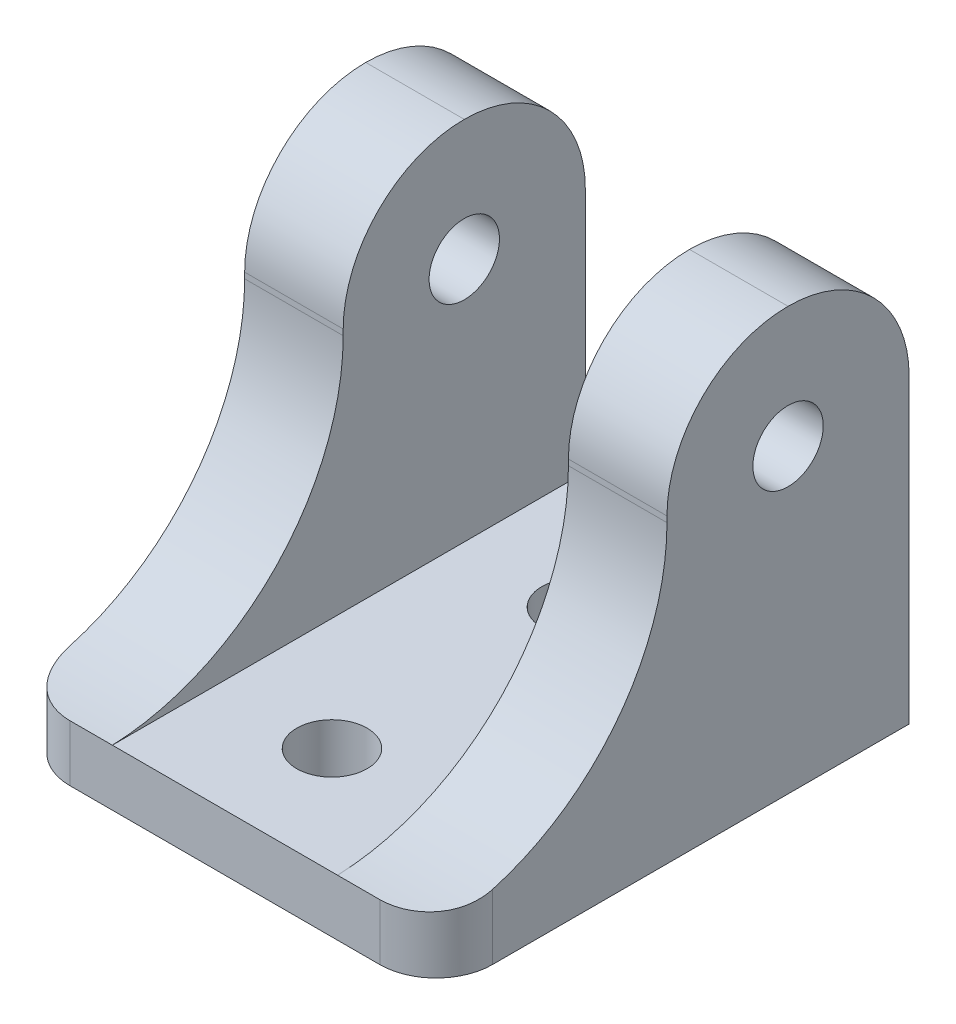
ISO-10303-21;
HEADER;
FILE_DESCRIPTION(('STEP AP214'),'2;1');
FILE_NAME('part.step','',(''),(''),'','','');
FILE_SCHEMA(('AUTOMOTIVE_DESIGN { 1 0 10303 214 1 1 1 1 }'));
ENDSEC;
DATA;
#1=APPLICATION_CONTEXT('core data for automotive mechanical design processes');
#2=APPLICATION_PROTOCOL_DEFINITION('international standard','automotive_design',2000,#1);
#3=PRODUCT_CONTEXT('',#1,'mechanical');
#4=PRODUCT('Part','Part','',(#3));
#5=PRODUCT_RELATED_PRODUCT_CATEGORY('part','',(#4));
#6=PRODUCT_DEFINITION_FORMATION('','',#4);
#7=PRODUCT_DEFINITION_CONTEXT('part definition',#1,'design');
#8=PRODUCT_DEFINITION('design','',#6,#7);
#9=PRODUCT_DEFINITION_SHAPE('','',#8);
#10=(LENGTH_UNIT() NAMED_UNIT(*) SI_UNIT(.MILLI.,.METRE.));
#11=(NAMED_UNIT(*) PLANE_ANGLE_UNIT() SI_UNIT($,.RADIAN.));
#12=(NAMED_UNIT(*) SI_UNIT($,.STERADIAN.) SOLID_ANGLE_UNIT());
#13=UNCERTAINTY_MEASURE_WITH_UNIT(LENGTH_MEASURE(1.E-05),#10,'distance_accuracy_value','');
#14=(GEOMETRIC_REPRESENTATION_CONTEXT(3) GLOBAL_UNCERTAINTY_ASSIGNED_CONTEXT((#13)) GLOBAL_UNIT_ASSIGNED_CONTEXT((#10,
#11,#12)) REPRESENTATION_CONTEXT('',''));
#15=CARTESIAN_POINT('',(0.,0.,0.));
#16=DIRECTION('',(0.,0.,1.));
#17=DIRECTION('',(1.,0.,0.));
#18=AXIS2_PLACEMENT_3D('',#15,#16,#17);
#19=CARTESIAN_POINT('',(0.,5.08,0.));
#20=DIRECTION('',(0.,1.,0.));
#21=DIRECTION('',(0.,0.,1.));
#22=AXIS2_PLACEMENT_3D('',#19,#20,#21);
#23=PLANE('',#22);
#24=CARTESIAN_POINT('',(1.65206317403409,5.08,13.9537678619551));
#25=DIRECTION('',(0.,1.,0.));
#26=DIRECTION('',(0.,0.,1.));
#27=AXIS2_PLACEMENT_3D('',#24,#25,#26);
#28=CIRCLE('',#27,3.175);
#29=CARTESIAN_POINT('',(1.65206317403409,5.08,17.1287678619551));
#30=VERTEX_POINT('',#29);
#31=EDGE_CURVE('E552',#30,#30,#28,.T.);
#32=ORIENTED_EDGE('',*,*,#31,.F.);
#33=EDGE_LOOP('',(#32));
#34=FACE_BOUND('',#33,.T.);
#35=CARTESIAN_POINT('',(1.65206317403409,5.08,-8.14423213804486));
#36=DIRECTION('',(0.,1.,0.));
#37=DIRECTION('',(0.,0.,1.));
#38=AXIS2_PLACEMENT_3D('',#35,#36,#37);
#39=CIRCLE('',#38,3.175);
#40=CARTESIAN_POINT('',(1.65206317403409,5.08,-4.96923213804486));
#41=VERTEX_POINT('',#40);
#42=EDGE_CURVE('E247',#41,#41,#39,.T.);
#43=ORIENTED_EDGE('',*,*,#42,.F.);
#44=EDGE_LOOP('',(#43));
#45=FACE_BOUND('',#44,.T.);
#46=DIRECTION('',(1.,0.,0.));
#47=VECTOR('',#46,1.);
#48=CARTESIAN_POINT('',(-17.3979368259659,5.08,23.6057678619551));
#49=LINE('',#48,#47);
#50=CARTESIAN_POINT('',(-8.50793682596591,5.08,23.6057678619551));
#51=VERTEX_POINT('',#50);
#52=CARTESIAN_POINT('',(11.8120631740341,5.08,23.6057678619551));
#53=VERTEX_POINT('',#52);
#54=EDGE_CURVE('E171',#51,#53,#49,.T.);
#55=ORIENTED_EDGE('',*,*,#54,.T.);
#56=DIRECTION('',(0.,0.,1.));
#57=VECTOR('',#56,1.);
#58=CARTESIAN_POINT('',(11.8120631740341,5.08,-19.0662321380449));
#59=LINE('',#58,#57);
#60=CARTESIAN_POINT('',(11.8120631740341,5.08,-19.0662321380449));
#61=VERTEX_POINT('',#60);
#62=EDGE_CURVE('E181',#61,#53,#59,.T.);
#63=ORIENTED_EDGE('',*,*,#62,.F.);
#64=DIRECTION('',(-1.,0.,0.));
#65=VECTOR('',#64,1.);
#66=CARTESIAN_POINT('',(-17.3979368259659,5.08,-19.0662321380449));
#67=LINE('',#66,#65);
#68=CARTESIAN_POINT('',(-8.50793682596592,5.08,-19.0662321380449));
#69=VERTEX_POINT('',#68);
#70=EDGE_CURVE('E176',#61,#69,#67,.T.);
#71=ORIENTED_EDGE('',*,*,#70,.T.);
#72=DIRECTION('',(0.,0.,-1.));
#73=VECTOR('',#72,1.);
#74=CARTESIAN_POINT('',(-8.50793682596592,5.08,-19.0662321380449));
#75=LINE('',#74,#73);
#76=EDGE_CURVE('E254',#51,#69,#75,.T.);
#77=ORIENTED_EDGE('',*,*,#76,.F.);
#78=EDGE_LOOP('',(#55,#63,#71,#77));
#79=FACE_BOUND('',#78,.T.);
#80=ADVANCED_FACE('F33',(#34,#45,#79),#23,.T.);
#81=CARTESIAN_POINT('',(-17.3979368259659,5.08,-19.0662321380449));
#82=DIRECTION('',(1.,0.,0.));
#83=DIRECTION('',(0.,0.,-1.));
#84=AXIS2_PLACEMENT_3D('',#81,#82,#83);
#85=PLANE('',#84);
#86=CARTESIAN_POINT('',(-17.3979368259659,27.178,-8.14423213804485));
#87=DIRECTION('',(1.,0.,0.));
#88=DIRECTION('',(0.,0.,-1.));
#89=AXIS2_PLACEMENT_3D('',#86,#87,#88);
#90=CIRCLE('',#89,3.17499999999999);
#91=CARTESIAN_POINT('',(-17.3979368259659,27.178,-11.3192321380448));
#92=VERTEX_POINT('',#91);
#93=EDGE_CURVE('E240',#92,#92,#90,.T.);
#94=ORIENTED_EDGE('',*,*,#93,.T.);
#95=EDGE_LOOP('',(#94));
#96=FACE_BOUND('',#95,.T.);
#97=DIRECTION('',(0.,0.,1.));
#98=VECTOR('',#97,1.);
#99=CARTESIAN_POINT('',(-17.3979368259659,0.,-19.0662321380449));
#100=LINE('',#99,#98);
#101=CARTESIAN_POINT('',(-17.3979368259659,0.,-19.0662321380449));
#102=VERTEX_POINT('',#101);
#103=CARTESIAN_POINT('',(-17.3979368259659,0.,18.5257678619551));
#104=VERTEX_POINT('',#103);
#105=EDGE_CURVE('E168',#102,#104,#100,.T.);
#106=ORIENTED_EDGE('',*,*,#105,.T.);
#107=DIRECTION('',(0.,-1.,0.));
#108=VECTOR('',#107,1.);
#109=CARTESIAN_POINT('',(-17.3979368259659,5.08,18.5257678619551));
#110=LINE('',#109,#108);
#111=CARTESIAN_POINT('',(-17.3979368259659,5.87195984469439,18.5257678619551));
#112=VERTEX_POINT('',#111);
#113=EDGE_CURVE('E57',#104,#112,#110,.F.);
#114=ORIENTED_EDGE('',*,*,#113,.T.);
#115=CARTESIAN_POINT('',(-17.3979368259659,26.6565487509008,24.3677678619551));
#116=DIRECTION('',(1.,0.,0.));
#117=DIRECTION('',(0.,0.,-1.));
#118=AXIS2_PLACEMENT_3D('',#115,#116,#117);
#119=CIRCLE('',#118,21.59);
#120=CARTESIAN_POINT('',(-17.3979368259659,26.6565487509008,2.77776786195515));
#121=VERTEX_POINT('',#120);
#122=EDGE_CURVE('E199',#112,#121,#119,.T.);
#123=ORIENTED_EDGE('',*,*,#122,.T.);
#124=DIRECTION('',(0.,-1.,0.));
#125=VECTOR('',#124,1.);
#126=CARTESIAN_POINT('',(-17.3979368259659,38.1,2.77776786195515));
#127=LINE('',#126,#125);
#128=CARTESIAN_POINT('',(-17.3979368259659,27.178,2.77776786195515));
#129=VERTEX_POINT('',#128);
#130=EDGE_CURVE('E263',#129,#121,#127,.T.);
#131=ORIENTED_EDGE('',*,*,#130,.F.);
#132=CARTESIAN_POINT('',(-17.3979368259659,27.178,-8.14423213804485));
#133=DIRECTION('',(1.,0.,0.));
#134=DIRECTION('',(0.,0.,-1.));
#135=AXIS2_PLACEMENT_3D('',#132,#133,#134);
#136=CIRCLE('',#135,10.922);
#137=CARTESIAN_POINT('',(-17.3979368259659,38.1,-8.14423213804485));
#138=VERTEX_POINT('',#137);
#139=EDGE_CURVE('E163',#129,#138,#136,.F.);
#140=ORIENTED_EDGE('',*,*,#139,.T.);
#141=CARTESIAN_POINT('',(-17.3979368259659,27.178,-8.14423213804486));
#142=DIRECTION('',(1.,0.,0.));
#143=DIRECTION('',(0.,0.,-1.));
#144=AXIS2_PLACEMENT_3D('',#141,#142,#143);
#145=CIRCLE('',#144,10.922);
#146=CARTESIAN_POINT('',(-17.3979368259659,27.178,-19.0662321380449));
#147=VERTEX_POINT('',#146);
#148=EDGE_CURVE('E288',#138,#147,#145,.F.);
#149=ORIENTED_EDGE('',*,*,#148,.T.);
#150=DIRECTION('',(0.,-1.,0.));
#151=VECTOR('',#150,1.);
#152=CARTESIAN_POINT('',(-17.3979368259659,5.08,-19.0662321380449));
#153=LINE('',#152,#151);
#154=EDGE_CURVE('E164',#147,#102,#153,.T.);
#155=ORIENTED_EDGE('',*,*,#154,.T.);
#156=EDGE_LOOP('',(#106,#114,#123,#131,#140,#149,#155));
#157=FACE_BOUND('',#156,.T.);
#158=ADVANCED_FACE('F345',(#96,#157),#85,.F.);
#159=CARTESIAN_POINT('',(-17.3979368259659,5.08,23.6057678619551));
#160=DIRECTION('',(0.,0.,-1.));
#161=DIRECTION('',(-1.,0.,0.));
#162=AXIS2_PLACEMENT_3D('',#159,#160,#161);
#163=PLANE('',#162);
#164=CARTESIAN_POINT('',(-12.3179368259659,5.08,23.6057678619551));
#165=VERTEX_POINT('',#164);
#166=EDGE_CURVE('E173',#165,#51,#49,.T.);
#167=ORIENTED_EDGE('',*,*,#166,.F.);
#168=DIRECTION('',(0.,-1.,0.));
#169=VECTOR('',#168,1.);
#170=CARTESIAN_POINT('',(-12.3179368259659,5.08,23.6057678619551));
#171=LINE('',#170,#169);
#172=CARTESIAN_POINT('',(-12.3179368259659,0.,23.6057678619551));
#173=VERTEX_POINT('',#172);
#174=EDGE_CURVE('E196',#165,#173,#171,.T.);
#175=ORIENTED_EDGE('',*,*,#174,.T.);
#176=DIRECTION('',(1.,0.,0.));
#177=VECTOR('',#176,1.);
#178=CARTESIAN_POINT('',(-17.3979368259659,0.,23.6057678619551));
#179=LINE('',#178,#177);
#180=CARTESIAN_POINT('',(15.6220631740341,0.,23.6057678619551));
#181=VERTEX_POINT('',#180);
#182=EDGE_CURVE('E152',#173,#181,#179,.T.);
#183=ORIENTED_EDGE('',*,*,#182,.T.);
#184=DIRECTION('',(0.,-1.,0.));
#185=VECTOR('',#184,1.);
#186=CARTESIAN_POINT('',(15.6220631740341,5.08,23.6057678619551));
#187=LINE('',#186,#185);
#188=CARTESIAN_POINT('',(15.6220631740341,5.08,23.6057678619551));
#189=VERTEX_POINT('',#188);
#190=EDGE_CURVE('E194',#181,#189,#187,.F.);
#191=ORIENTED_EDGE('',*,*,#190,.T.);
#192=EDGE_CURVE('E169',#53,#189,#49,.T.);
#193=ORIENTED_EDGE('',*,*,#192,.F.);
#194=ORIENTED_EDGE('',*,*,#54,.F.);
#195=EDGE_LOOP('',(#167,#175,#183,#191,#193,#194));
#196=FACE_BOUND('',#195,.T.);
#197=ADVANCED_FACE('F192',(#196),#163,.F.);
#198=CARTESIAN_POINT('',(20.7020631740341,5.08,-19.0662321380449));
#199=DIRECTION('',(-1.,0.,0.));
#200=DIRECTION('',(0.,0.,1.));
#201=AXIS2_PLACEMENT_3D('',#198,#199,#200);
#202=PLANE('',#201);
#203=CARTESIAN_POINT('',(20.7020631740341,27.178,-8.14423213804486));
#204=DIRECTION('',(1.,0.,0.));
#205=DIRECTION('',(0.,0.,-1.));
#206=AXIS2_PLACEMENT_3D('',#203,#204,#205);
#207=CIRCLE('',#206,3.175);
#208=CARTESIAN_POINT('',(20.7020631740341,27.178,-11.3192321380449));
#209=VERTEX_POINT('',#208);
#210=EDGE_CURVE('E236',#209,#209,#207,.T.);
#211=ORIENTED_EDGE('',*,*,#210,.F.);
#212=EDGE_LOOP('',(#211));
#213=FACE_BOUND('',#212,.T.);
#214=CARTESIAN_POINT('',(20.7020631740341,26.6565487509008,24.3677678619551));
#215=DIRECTION('',(-1.,0.,0.));
#216=DIRECTION('',(0.,0.,1.));
#217=AXIS2_PLACEMENT_3D('',#214,#215,#216);
#218=CIRCLE('',#217,21.59);
#219=CARTESIAN_POINT('',(20.7020631740341,26.6565487509008,2.77776786195515));
#220=VERTEX_POINT('',#219);
#221=CARTESIAN_POINT('',(20.7020631740341,5.87195984469439,18.5257678619551));
#222=VERTEX_POINT('',#221);
#223=EDGE_CURVE('E318',#220,#222,#218,.T.);
#224=ORIENTED_EDGE('',*,*,#223,.T.);
#225=DIRECTION('',(0.,-1.,0.));
#226=VECTOR('',#225,1.);
#227=CARTESIAN_POINT('',(20.7020631740341,5.08,18.5257678619551));
#228=LINE('',#227,#226);
#229=CARTESIAN_POINT('',(20.7020631740341,0.,18.5257678619551));
#230=VERTEX_POINT('',#229);
#231=EDGE_CURVE('E43',#222,#230,#228,.T.);
#232=ORIENTED_EDGE('',*,*,#231,.T.);
#233=DIRECTION('',(0.,0.,-1.));
#234=VECTOR('',#233,1.);
#235=CARTESIAN_POINT('',(20.7020631740341,0.,-19.0662321380449));
#236=LINE('',#235,#234);
#237=CARTESIAN_POINT('',(20.7020631740341,0.,-19.0662321380449));
#238=VERTEX_POINT('',#237);
#239=EDGE_CURVE('E144',#230,#238,#236,.T.);
#240=ORIENTED_EDGE('',*,*,#239,.T.);
#241=DIRECTION('',(0.,-1.,0.));
#242=VECTOR('',#241,1.);
#243=CARTESIAN_POINT('',(20.7020631740341,5.08,-19.0662321380449));
#244=LINE('',#243,#242);
#245=CARTESIAN_POINT('',(20.7020631740341,27.178,-19.0662321380449));
#246=VERTEX_POINT('',#245);
#247=EDGE_CURVE('E147',#246,#238,#244,.T.);
#248=ORIENTED_EDGE('',*,*,#247,.F.);
#249=CARTESIAN_POINT('',(20.7020631740341,27.178,-8.14423213804486));
#250=DIRECTION('',(-1.,0.,0.));
#251=DIRECTION('',(0.,0.,1.));
#252=AXIS2_PLACEMENT_3D('',#249,#250,#251);
#253=CIRCLE('',#252,10.922);
#254=CARTESIAN_POINT('',(20.7020631740341,38.1,-8.14423213804485));
#255=VERTEX_POINT('',#254);
#256=EDGE_CURVE('E302',#246,#255,#253,.F.);
#257=ORIENTED_EDGE('',*,*,#256,.T.);
#258=CARTESIAN_POINT('',(20.7020631740341,27.178,-8.14423213804485));
#259=DIRECTION('',(-1.,0.,0.));
#260=DIRECTION('',(0.,0.,1.));
#261=AXIS2_PLACEMENT_3D('',#258,#259,#260);
#262=CIRCLE('',#261,10.922);
#263=CARTESIAN_POINT('',(20.7020631740341,27.178,2.77776786195515));
#264=VERTEX_POINT('',#263);
#265=EDGE_CURVE('E281',#255,#264,#262,.F.);
#266=ORIENTED_EDGE('',*,*,#265,.T.);
#267=DIRECTION('',(0.,-1.,0.));
#268=VECTOR('',#267,1.);
#269=CARTESIAN_POINT('',(20.7020631740341,38.1,2.77776786195515));
#270=LINE('',#269,#268);
#271=EDGE_CURVE('E267',#264,#220,#270,.T.);
#272=ORIENTED_EDGE('',*,*,#271,.T.);
#273=EDGE_LOOP('',(#224,#232,#240,#248,#257,#266,#272));
#274=FACE_BOUND('',#273,.T.);
#275=ADVANCED_FACE('F146',(#213,#274),#202,.F.);
#276=CARTESIAN_POINT('',(-17.3979368259659,5.08,-19.0662321380449));
#277=DIRECTION('',(0.,0.,1.));
#278=DIRECTION('',(1.,0.,0.));
#279=AXIS2_PLACEMENT_3D('',#276,#277,#278);
#280=PLANE('',#279);
#281=ORIENTED_EDGE('',*,*,#154,.F.);
#282=DIRECTION('',(-1.,0.,0.));
#283=VECTOR('',#282,1.);
#284=CARTESIAN_POINT('',(-8.50793682596592,27.178,-19.0662321380449));
#285=LINE('',#284,#283);
#286=CARTESIAN_POINT('',(-8.50793682596592,27.178,-19.0662321380449));
#287=VERTEX_POINT('',#286);
#288=EDGE_CURVE('E291',#147,#287,#285,.F.);
#289=ORIENTED_EDGE('',*,*,#288,.T.);
#290=DIRECTION('',(0.,-1.,0.));
#291=VECTOR('',#290,1.);
#292=CARTESIAN_POINT('',(-8.50793682596592,38.1,-19.0662321380449));
#293=LINE('',#292,#291);
#294=EDGE_CURVE('E257',#287,#69,#293,.T.);
#295=ORIENTED_EDGE('',*,*,#294,.T.);
#296=ORIENTED_EDGE('',*,*,#70,.F.);
#297=DIRECTION('',(0.,-1.,0.));
#298=VECTOR('',#297,1.);
#299=CARTESIAN_POINT('',(11.8120631740341,38.1,-19.0662321380449));
#300=LINE('',#299,#298);
#301=CARTESIAN_POINT('',(11.8120631740341,27.178,-19.0662321380449));
#302=VERTEX_POINT('',#301);
#303=EDGE_CURVE('E186',#302,#61,#300,.T.);
#304=ORIENTED_EDGE('',*,*,#303,.F.);
#305=DIRECTION('',(-1.,0.,0.));
#306=VECTOR('',#305,1.);
#307=CARTESIAN_POINT('',(-17.3979368259659,27.178,-19.0662321380449));
#308=LINE('',#307,#306);
#309=EDGE_CURVE('E162',#302,#246,#308,.F.);
#310=ORIENTED_EDGE('',*,*,#309,.T.);
#311=ORIENTED_EDGE('',*,*,#247,.T.);
#312=DIRECTION('',(-1.,0.,0.));
#313=VECTOR('',#312,1.);
#314=CARTESIAN_POINT('',(-17.3979368259659,0.,-19.0662321380449));
#315=LINE('',#314,#313);
#316=EDGE_CURVE('E151',#238,#102,#315,.T.);
#317=ORIENTED_EDGE('',*,*,#316,.T.);
#318=EDGE_LOOP('',(#281,#289,#295,#296,#304,#310,#311,#317));
#319=FACE_BOUND('',#318,.T.);
#320=ADVANCED_FACE('F158',(#319),#280,.F.);
#321=CARTESIAN_POINT('',(0.,0.,0.));
#322=DIRECTION('',(0.,1.,0.));
#323=DIRECTION('',(0.,0.,1.));
#324=AXIS2_PLACEMENT_3D('',#321,#322,#323);
#325=PLANE('',#324);
#326=CARTESIAN_POINT('',(1.65206317403409,0.,13.9537678619551));
#327=DIRECTION('',(0.,1.,0.));
#328=DIRECTION('',(0.,0.,1.));
#329=AXIS2_PLACEMENT_3D('',#326,#327,#328);
#330=CIRCLE('',#329,3.17499999999999);
#331=CARTESIAN_POINT('',(1.65206317403409,0.,17.1287678619551));
#332=VERTEX_POINT('',#331);
#333=EDGE_CURVE('E555',#332,#332,#330,.T.);
#334=ORIENTED_EDGE('',*,*,#333,.T.);
#335=EDGE_LOOP('',(#334));
#336=FACE_BOUND('',#335,.T.);
#337=CARTESIAN_POINT('',(1.65206317403409,0.,-8.14423213804486));
#338=DIRECTION('',(0.,1.,0.));
#339=DIRECTION('',(0.,0.,1.));
#340=AXIS2_PLACEMENT_3D('',#337,#338,#339);
#341=CIRCLE('',#340,3.17499999999999);
#342=CARTESIAN_POINT('',(1.65206317403409,0.,-4.96923213804486));
#343=VERTEX_POINT('',#342);
#344=EDGE_CURVE('E38',#343,#343,#341,.T.);
#345=ORIENTED_EDGE('',*,*,#344,.T.);
#346=EDGE_LOOP('',(#345));
#347=FACE_BOUND('',#346,.T.);
#348=ORIENTED_EDGE('',*,*,#182,.F.);
#349=CARTESIAN_POINT('',(-12.3179368259659,0.,18.5257678619551));
#350=DIRECTION('',(0.,1.,0.));
#351=DIRECTION('',(0.,0.,1.));
#352=AXIS2_PLACEMENT_3D('',#349,#350,#351);
#353=CIRCLE('',#352,5.08);
#354=EDGE_CURVE('E207',#173,#104,#353,.F.);
#355=ORIENTED_EDGE('',*,*,#354,.T.);
#356=ORIENTED_EDGE('',*,*,#105,.F.);
#357=ORIENTED_EDGE('',*,*,#316,.F.);
#358=ORIENTED_EDGE('',*,*,#239,.F.);
#359=CARTESIAN_POINT('',(15.6220631740341,0.,18.5257678619551));
#360=DIRECTION('',(0.,1.,0.));
#361=DIRECTION('',(0.,0.,1.));
#362=AXIS2_PLACEMENT_3D('',#359,#360,#361);
#363=CIRCLE('',#362,5.08);
#364=EDGE_CURVE('E198',#230,#181,#363,.F.);
#365=ORIENTED_EDGE('',*,*,#364,.T.);
#366=EDGE_LOOP('',(#348,#355,#356,#357,#358,#365));
#367=FACE_BOUND('',#366,.T.);
#368=ADVANCED_FACE('F167',(#336,#347,#367),#325,.F.);
#369=CARTESIAN_POINT('',(11.8120631740341,38.1,-19.0662321380449));
#370=DIRECTION('',(1.,0.,0.));
#371=DIRECTION('',(0.,0.,-1.));
#372=AXIS2_PLACEMENT_3D('',#369,#370,#371);
#373=PLANE('',#372);
#374=CARTESIAN_POINT('',(11.8120631740341,27.178,-8.14423213804485));
#375=DIRECTION('',(1.,0.,0.));
#376=DIRECTION('',(0.,0.,-1.));
#377=AXIS2_PLACEMENT_3D('',#374,#375,#376);
#378=CIRCLE('',#377,3.17499999999999);
#379=CARTESIAN_POINT('',(11.8120631740341,27.178,-11.3192321380448));
#380=VERTEX_POINT('',#379);
#381=EDGE_CURVE('E235',#380,#380,#378,.T.);
#382=ORIENTED_EDGE('',*,*,#381,.T.);
#383=EDGE_LOOP('',(#382));
#384=FACE_BOUND('',#383,.T.);
#385=CARTESIAN_POINT('',(11.8120631740341,27.178,-8.14423213804485));
#386=DIRECTION('',(1.,0.,0.));
#387=DIRECTION('',(0.,0.,-1.));
#388=AXIS2_PLACEMENT_3D('',#385,#386,#387);
#389=CIRCLE('',#388,10.922);
#390=CARTESIAN_POINT('',(11.8120631740341,27.178,2.77776786195515));
#391=VERTEX_POINT('',#390);
#392=CARTESIAN_POINT('',(11.8120631740341,38.1,-8.14423213804485));
#393=VERTEX_POINT('',#392);
#394=EDGE_CURVE('E297',#391,#393,#389,.F.);
#395=ORIENTED_EDGE('',*,*,#394,.T.);
#396=CARTESIAN_POINT('',(11.8120631740341,27.178,-8.14423213804486));
#397=DIRECTION('',(1.,0.,0.));
#398=DIRECTION('',(0.,0.,-1.));
#399=AXIS2_PLACEMENT_3D('',#396,#397,#398);
#400=CIRCLE('',#399,10.922);
#401=EDGE_CURVE('E279',#393,#302,#400,.F.);
#402=ORIENTED_EDGE('',*,*,#401,.T.);
#403=ORIENTED_EDGE('',*,*,#303,.T.);
#404=ORIENTED_EDGE('',*,*,#62,.T.);
#405=CARTESIAN_POINT('',(11.8120631740341,26.6565487509008,24.3677678619551));
#406=DIRECTION('',(1.,0.,0.));
#407=DIRECTION('',(0.,0.,-1.));
#408=AXIS2_PLACEMENT_3D('',#405,#406,#407);
#409=CIRCLE('',#408,21.59);
#410=CARTESIAN_POINT('',(11.8120631740341,26.6565487509008,2.77776786195515));
#411=VERTEX_POINT('',#410);
#412=EDGE_CURVE('E320',#53,#411,#409,.T.);
#413=ORIENTED_EDGE('',*,*,#412,.T.);
#414=DIRECTION('',(0.,-1.,0.));
#415=VECTOR('',#414,1.);
#416=CARTESIAN_POINT('',(11.8120631740341,38.1,2.77776786195515));
#417=LINE('',#416,#415);
#418=EDGE_CURVE('E265',#391,#411,#417,.T.);
#419=ORIENTED_EDGE('',*,*,#418,.F.);
#420=EDGE_LOOP('',(#395,#402,#403,#404,#413,#419));
#421=FACE_BOUND('',#420,.T.);
#422=ADVANCED_FACE('F367',(#384,#421),#373,.F.);
#423=CARTESIAN_POINT('',(20.7020631740341,38.1,2.77776786195515));
#424=DIRECTION('',(0.,0.,-1.));
#425=DIRECTION('',(-1.,0.,0.));
#426=AXIS2_PLACEMENT_3D('',#423,#424,#425);
#427=PLANE('',#426);
#428=ORIENTED_EDGE('',*,*,#418,.T.);
#429=DIRECTION('',(-1.,0.,0.));
#430=VECTOR('',#429,1.);
#431=CARTESIAN_POINT('',(20.7020631740341,26.6565487509008,2.77776786195515));
#432=LINE('',#431,#430);
#433=EDGE_CURVE('E309',#411,#220,#432,.F.);
#434=ORIENTED_EDGE('',*,*,#433,.T.);
#435=ORIENTED_EDGE('',*,*,#271,.F.);
#436=DIRECTION('',(1.,0.,0.));
#437=VECTOR('',#436,1.);
#438=CARTESIAN_POINT('',(20.7020631740341,27.178,2.77776786195515));
#439=LINE('',#438,#437);
#440=EDGE_CURVE('E304',#264,#391,#439,.F.);
#441=ORIENTED_EDGE('',*,*,#440,.T.);
#442=EDGE_LOOP('',(#428,#434,#435,#441));
#443=FACE_BOUND('',#442,.T.);
#444=ADVANCED_FACE('F389',(#443),#427,.F.);
#445=CARTESIAN_POINT('',(-17.3979368259659,38.1,2.77776786195515));
#446=DIRECTION('',(0.,0.,-1.));
#447=DIRECTION('',(-1.,0.,0.));
#448=AXIS2_PLACEMENT_3D('',#445,#446,#447);
#449=PLANE('',#448);
#450=ORIENTED_EDGE('',*,*,#130,.T.);
#451=DIRECTION('',(-1.,0.,0.));
#452=VECTOR('',#451,1.);
#453=CARTESIAN_POINT('',(-17.3979368259659,26.6565487509008,2.77776786195515));
#454=LINE('',#453,#452);
#455=CARTESIAN_POINT('',(-8.50793682596591,26.6565487509008,2.77776786195515));
#456=VERTEX_POINT('',#455);
#457=EDGE_CURVE('E315',#121,#456,#454,.F.);
#458=ORIENTED_EDGE('',*,*,#457,.T.);
#459=DIRECTION('',(0.,-1.,0.));
#460=VECTOR('',#459,1.);
#461=CARTESIAN_POINT('',(-8.50793682596591,38.1,2.77776786195515));
#462=LINE('',#461,#460);
#463=CARTESIAN_POINT('',(-8.50793682596591,27.178,2.77776786195515));
#464=VERTEX_POINT('',#463);
#465=EDGE_CURVE('E260',#464,#456,#462,.T.);
#466=ORIENTED_EDGE('',*,*,#465,.F.);
#467=DIRECTION('',(1.,0.,0.));
#468=VECTOR('',#467,1.);
#469=CARTESIAN_POINT('',(-17.3979368259659,27.178,2.77776786195515));
#470=LINE('',#469,#468);
#471=EDGE_CURVE('E305',#464,#129,#470,.F.);
#472=ORIENTED_EDGE('',*,*,#471,.T.);
#473=EDGE_LOOP('',(#450,#458,#466,#472));
#474=FACE_BOUND('',#473,.T.);
#475=ADVANCED_FACE('F348',(#474),#449,.F.);
#476=CARTESIAN_POINT('',(-8.50793682596592,38.1,-19.0662321380449));
#477=DIRECTION('',(-1.,0.,0.));
#478=DIRECTION('',(0.,0.,1.));
#479=AXIS2_PLACEMENT_3D('',#476,#477,#478);
#480=PLANE('',#479);
#481=CARTESIAN_POINT('',(-8.50793682596592,27.178,-8.14423213804485));
#482=DIRECTION('',(-1.,0.,0.));
#483=DIRECTION('',(0.,0.,1.));
#484=AXIS2_PLACEMENT_3D('',#481,#482,#483);
#485=CIRCLE('',#484,3.17499999999999);
#486=CARTESIAN_POINT('',(-8.50793682596592,27.178,-4.96923213804486));
#487=VERTEX_POINT('',#486);
#488=EDGE_CURVE('E233',#487,#487,#485,.T.);
#489=ORIENTED_EDGE('',*,*,#488,.T.);
#490=EDGE_LOOP('',(#489));
#491=FACE_BOUND('',#490,.T.);
#492=ORIENTED_EDGE('',*,*,#294,.F.);
#493=CARTESIAN_POINT('',(-8.50793682596592,27.178,-8.14423213804486));
#494=DIRECTION('',(-1.,0.,0.));
#495=DIRECTION('',(0.,0.,1.));
#496=AXIS2_PLACEMENT_3D('',#493,#494,#495);
#497=CIRCLE('',#496,10.922);
#498=CARTESIAN_POINT('',(-8.50793682596592,38.1,-8.14423213804485));
#499=VERTEX_POINT('',#498);
#500=EDGE_CURVE('E296',#287,#499,#497,.F.);
#501=ORIENTED_EDGE('',*,*,#500,.T.);
#502=CARTESIAN_POINT('',(-8.50793682596592,27.178,-8.14423213804485));
#503=DIRECTION('',(-1.,0.,0.));
#504=DIRECTION('',(0.,0.,1.));
#505=AXIS2_PLACEMENT_3D('',#502,#503,#504);
#506=CIRCLE('',#505,10.922);
#507=EDGE_CURVE('E294',#499,#464,#506,.F.);
#508=ORIENTED_EDGE('',*,*,#507,.T.);
#509=ORIENTED_EDGE('',*,*,#465,.T.);
#510=CARTESIAN_POINT('',(-8.50793682596591,26.6565487509008,24.3677678619551));
#511=DIRECTION('',(-1.,0.,0.));
#512=DIRECTION('',(0.,0.,1.));
#513=AXIS2_PLACEMENT_3D('',#510,#511,#512);
#514=CIRCLE('',#513,21.59);
#515=EDGE_CURVE('E202',#456,#51,#514,.T.);
#516=ORIENTED_EDGE('',*,*,#515,.T.);
#517=ORIENTED_EDGE('',*,*,#76,.T.);
#518=EDGE_LOOP('',(#492,#501,#508,#509,#516,#517));
#519=FACE_BOUND('',#518,.T.);
#520=ADVANCED_FACE('F325',(#491,#519),#480,.F.);
#521=CARTESIAN_POINT('',(0.,27.178,-8.14423213804485));
#522=DIRECTION('',(-1.,0.,0.));
#523=DIRECTION('',(0.,0.,1.));
#524=AXIS2_PLACEMENT_3D('',#521,#522,#523);
#525=CYLINDRICAL_SURFACE('',#524,10.922);
#526=ORIENTED_EDGE('',*,*,#471,.F.);
#527=ORIENTED_EDGE('',*,*,#507,.F.);
#528=DIRECTION('',(1.,0.,0.));
#529=VECTOR('',#528,1.);
#530=CARTESIAN_POINT('',(-8.50793682596591,38.1,-8.14423213804485));
#531=LINE('',#530,#529);
#532=EDGE_CURVE('E258',#138,#499,#531,.T.);
#533=ORIENTED_EDGE('',*,*,#532,.F.);
#534=ORIENTED_EDGE('',*,*,#139,.F.);
#535=EDGE_LOOP('',(#526,#527,#533,#534));
#536=FACE_BOUND('',#535,.T.);
#537=ADVANCED_FACE('F341',(#536),#525,.T.);
#538=CARTESIAN_POINT('',(0.,27.178,-8.14423213804486));
#539=DIRECTION('',(1.,0.,0.));
#540=DIRECTION('',(0.,0.,-1.));
#541=AXIS2_PLACEMENT_3D('',#538,#539,#540);
#542=CYLINDRICAL_SURFACE('',#541,10.922);
#543=ORIENTED_EDGE('',*,*,#500,.F.);
#544=ORIENTED_EDGE('',*,*,#288,.F.);
#545=ORIENTED_EDGE('',*,*,#148,.F.);
#546=ORIENTED_EDGE('',*,*,#532,.T.);
#547=EDGE_LOOP('',(#543,#544,#545,#546));
#548=FACE_BOUND('',#547,.T.);
#549=ADVANCED_FACE('F344',(#548),#542,.T.);
#550=CARTESIAN_POINT('',(0.,27.178,-8.14423213804485));
#551=DIRECTION('',(1.,0.,0.));
#552=DIRECTION('',(0.,0.,-1.));
#553=AXIS2_PLACEMENT_3D('',#550,#551,#552);
#554=CYLINDRICAL_SURFACE('',#553,10.922);
#555=ORIENTED_EDGE('',*,*,#440,.F.);
#556=ORIENTED_EDGE('',*,*,#265,.F.);
#557=DIRECTION('',(1.,0.,0.));
#558=VECTOR('',#557,1.);
#559=CARTESIAN_POINT('',(0.,38.1,-8.14423213804485));
#560=LINE('',#559,#558);
#561=EDGE_CURVE('E253',#393,#255,#560,.T.);
#562=ORIENTED_EDGE('',*,*,#561,.F.);
#563=ORIENTED_EDGE('',*,*,#394,.F.);
#564=EDGE_LOOP('',(#555,#556,#562,#563));
#565=FACE_BOUND('',#564,.T.);
#566=ADVANCED_FACE('F228',(#565),#554,.T.);
#567=CARTESIAN_POINT('',(0.,27.178,-8.14423213804486));
#568=DIRECTION('',(-1.,0.,0.));
#569=DIRECTION('',(0.,0.,1.));
#570=AXIS2_PLACEMENT_3D('',#567,#568,#569);
#571=CYLINDRICAL_SURFACE('',#570,10.922);
#572=ORIENTED_EDGE('',*,*,#256,.F.);
#573=ORIENTED_EDGE('',*,*,#309,.F.);
#574=ORIENTED_EDGE('',*,*,#401,.F.);
#575=ORIENTED_EDGE('',*,*,#561,.T.);
#576=EDGE_LOOP('',(#572,#573,#574,#575));
#577=FACE_BOUND('',#576,.T.);
#578=ADVANCED_FACE('F227',(#577),#571,.T.);
#579=CARTESIAN_POINT('',(0.,26.6565487509008,24.3677678619551));
#580=DIRECTION('',(-1.,0.,0.));
#581=DIRECTION('',(0.,0.,1.));
#582=AXIS2_PLACEMENT_3D('',#579,#580,#581);
#583=CYLINDRICAL_SURFACE('',#582,21.59);
#584=ORIENTED_EDGE('',*,*,#192,.T.);
#585=CARTESIAN_POINT('',(15.6220631740341,5.08,23.6057678619551));
#586=CARTESIAN_POINT('',(15.7646720487406,5.08001008685265,23.6057832142));
#587=CARTESIAN_POINT('',(15.9072789176374,5.08021238927275,23.5997633981997));
#588=CARTESIAN_POINT('',(16.1914759808762,5.08107432246816,23.5757641295451));
#589=CARTESIAN_POINT('',(16.3330662151689,5.08173393517209,23.5577851494783));
#590=CARTESIAN_POINT('',(16.6141434202166,5.08358281397527,23.5099927495393));
#591=CARTESIAN_POINT('',(16.7536316157941,5.08477175824665,23.4801865217014));
#592=CARTESIAN_POINT('',(17.0296004571888,5.08781996714158,23.4089577590581));
#593=CARTESIAN_POINT('',(17.1660811441107,5.08967922259771,23.3675353831213));
#594=CARTESIAN_POINT('',(17.4351148406846,5.09425352605767,23.2733529496676));
#595=CARTESIAN_POINT('',(17.5676663892668,5.09696888814782,23.2205887333484));
#596=CARTESIAN_POINT('',(17.8278906233721,5.10348337429342,23.1040922735691));
#597=CARTESIAN_POINT('',(17.9555614861968,5.10728289883273,23.0403559805397));
#598=CARTESIAN_POINT('',(18.2049868491268,5.11622225294677,22.9024335834978));
#599=CARTESIAN_POINT('',(18.326744596966,5.12136133667195,22.8282533051));
#600=CARTESIAN_POINT('',(18.5635872251856,5.13326439872491,22.6699364159203));
#601=CARTESIAN_POINT('',(18.6786696445795,5.14002897165275,22.585796167533));
#602=CARTESIAN_POINT('',(18.9008943467113,5.15544761939437,22.4085243397939));
#603=CARTESIAN_POINT('',(19.0080629136312,5.1640950242859,22.3154251312323));
#604=CARTESIAN_POINT('',(19.2141727371925,5.18358456261097,22.1206613956239));
#605=CARTESIAN_POINT('',(19.3131109296044,5.19442750834688,22.0189937065767));
#606=CARTESIAN_POINT('',(19.5019740747231,5.21857503580022,21.8079523391342));
#607=CARTESIAN_POINT('',(19.5919027261836,5.23187860090413,21.6985818546895));
#608=CARTESIAN_POINT('',(19.7621984299993,5.2612018848553,21.4729137231892));
#609=CARTESIAN_POINT('',(19.8425620520544,5.27722257317766,21.3566136132706));
#610=CARTESIAN_POINT('',(19.9925177328902,5.3120367030547,21.1190460450638));
#611=CARTESIAN_POINT('',(20.0621946763778,5.33080569915699,20.9978285730344));
#612=CARTESIAN_POINT('',(20.1911507993048,5.37136713180921,20.7504688768646));
#613=CARTESIAN_POINT('',(20.2504298195714,5.39315961463394,20.6243265773705));
#614=CARTESIAN_POINT('',(20.3582578130906,5.43986486209735,20.368096349638));
#615=CARTESIAN_POINT('',(20.406807201012,5.46477750609263,20.2380085741018));
#616=CARTESIAN_POINT('',(20.4929483933551,5.51774453472129,19.9749230210156));
#617=CARTESIAN_POINT('',(20.5305414157867,5.54579856964858,19.8419255687005));
#618=CARTESIAN_POINT('',(20.6092572010882,5.61853159605833,19.5129045697866));
#619=CARTESIAN_POINT('',(20.6442023837222,5.66496679013351,19.3157396809046));
#620=CARTESIAN_POINT('',(20.6789987766633,5.73924020166254,19.0194310047201));
#621=CARTESIAN_POINT('',(20.6876607633636,5.76474891705546,18.9206362543109));
#622=CARTESIAN_POINT('',(20.6991923796209,5.81725431508005,18.7230929865899));
#623=CARTESIAN_POINT('',(20.7020614402791,5.84425114358558,18.624344474771));
#624=CARTESIAN_POINT('',(20.7020631740341,5.87195984469439,18.5257678619551));
#625=B_SPLINE_CURVE_WITH_KNOTS('',3,(#585,#586,#587,#588,#589,#590,#591,#592,#593,#594,#595,
#596,#597,#598,#599,#600,#601,#602,#603,#604,#605,#606,#607,#608,#609,#610,#611,#612,#613,#614,
#615,#616,#617,#618,#619,#620,#621,#622,#623,#624),.UNSPECIFIED.,.F.,.F.,(4,2,2,2,2,2,2,2,2,2,2,
2,2,2,2,2,2,2,2,4),(0.,0.427696690671221,0.855376481157745,1.28279660129265,1.71021087608785,
2.13778214241299,2.56551155622019,2.99300332255292,3.42065170303974,3.84680909938535,
4.2731244537392,4.69926406626385,5.12555604738171,5.5482638258844,5.9709780746911,
6.39367598397254,6.81632688434822,7.43129657206678,7.73835793814346,8.04544945794983),.UNSPECIFIED.);
#626=EDGE_CURVE('E11',#189,#222,#625,.T.);
#627=ORIENTED_EDGE('',*,*,#626,.T.);
#628=ORIENTED_EDGE('',*,*,#223,.F.);
#629=ORIENTED_EDGE('',*,*,#433,.F.);
#630=ORIENTED_EDGE('',*,*,#412,.F.);
#631=EDGE_LOOP('',(#584,#627,#628,#629,#630));
#632=FACE_BOUND('',#631,.T.);
#633=ADVANCED_FACE('F222',(#632),#583,.F.);
#634=CARTESIAN_POINT('',(0.,26.6565487509008,24.3677678619551));
#635=DIRECTION('',(-1.,0.,0.));
#636=DIRECTION('',(0.,0.,1.));
#637=AXIS2_PLACEMENT_3D('',#634,#635,#636);
#638=CYLINDRICAL_SURFACE('',#637,21.59);
#639=ORIENTED_EDGE('',*,*,#122,.F.);
#640=CARTESIAN_POINT('',(-17.3979368259659,5.87195984469439,18.5257678619551));
#641=CARTESIAN_POINT('',(-17.3979524094548,5.83299236362997,18.6643553962869));
#642=CARTESIAN_POINT('',(-17.3922658774377,5.79543333386682,18.8033525302227));
#643=CARTESIAN_POINT('',(-17.3694006295632,5.72330342017821,19.08120122745));
#644=CARTESIAN_POINT('',(-17.3522198768865,5.68873306708384,19.220052760572));
#645=CARTESIAN_POINT('',(-17.3062776583982,5.62276495824885,19.4965987230579));
#646=CARTESIAN_POINT('',(-17.277515935656,5.59136727291513,19.634293126681));
#647=CARTESIAN_POINT('',(-17.2084532249541,5.5318393357682,19.9074671796383));
#648=CARTESIAN_POINT('',(-17.1681531753393,5.50370881851665,20.0429470081243));
#649=CARTESIAN_POINT('',(-17.076087868658,5.45069748069688,20.3108419015932));
#650=CARTESIAN_POINT('',(-17.0243057417447,5.42582152824556,20.4432521371438));
#651=CARTESIAN_POINT('',(-16.9095504472197,5.37931120613339,20.7037836470155));
#652=CARTESIAN_POINT('',(-16.8465731055665,5.3576780510866,20.8319033003826));
#653=CARTESIAN_POINT('',(-16.7098840441165,5.31756785644832,21.0826345907761));
#654=CARTESIAN_POINT('',(-16.6361828351408,5.29908776453023,21.2052514690282));
#655=CARTESIAN_POINT('',(-16.4784559993272,5.26507509072982,21.4441535800628));
#656=CARTESIAN_POINT('',(-16.3944266039559,5.2495435900163,21.5604364792447));
#657=CARTESIAN_POINT('',(-16.2185633367745,5.22151355008799,21.7832550881516));
#658=CARTESIAN_POINT('',(-16.1269358693534,5.2089570302142,21.8899465131447));
#659=CARTESIAN_POINT('',(-15.9349748673216,5.18620291896923,22.0955327653726));
#660=CARTESIAN_POINT('',(-15.8346381524587,5.17600619432157,22.1944247191952));
#661=CARTESIAN_POINT('',(-15.625998183622,5.15770554618436,22.3836118055603));
#662=CARTESIAN_POINT('',(-15.5176953866836,5.14960150275227,22.4739074306162));
#663=CARTESIAN_POINT('',(-15.2938425987956,5.13519926159072,22.6452654964773));
#664=CARTESIAN_POINT('',(-15.1782900116603,5.12890171532732,22.7263246000362));
#665=CARTESIAN_POINT('',(-14.9407199995045,5.11783067736169,22.8786207172638));
#666=CARTESIAN_POINT('',(-14.8186988535897,5.11305807418736,22.9498519909372));
#667=CARTESIAN_POINT('',(-14.5691156064825,5.10477209766151,23.0819208432047));
#668=CARTESIAN_POINT('',(-14.4415534432854,5.10125873840514,23.1427583054536));
#669=CARTESIAN_POINT('',(-14.1818300627092,5.09524609984484,23.2535815989391));
#670=CARTESIAN_POINT('',(-14.0496706946302,5.09274641777971,23.3035717364318));
#671=CARTESIAN_POINT('',(-13.7816850268174,5.08854795763336,23.3923662156176));
#672=CARTESIAN_POINT('',(-13.6458593793742,5.08684903806362,23.4311725329336));
#673=CARTESIAN_POINT('',(-13.3137839088727,5.0834937322518,23.5112260388409));
#674=CARTESIAN_POINT('',(-13.1160846789732,5.08215405268877,23.5466703324305));
#675=CARTESIAN_POINT('',(-12.8176818323972,5.08084541991351,23.5821207409012));
#676=CARTESIAN_POINT('',(-12.7179425366533,5.08052601210299,23.5909848646138));
#677=CARTESIAN_POINT('',(-12.5181241148376,5.0801042693045,23.6028074309579));
#678=CARTESIAN_POINT('',(-12.418045024044,5.08000191243283,23.605766468955));
#679=CARTESIAN_POINT('',(-12.3179368259659,5.08,23.6057678619551));
#680=B_SPLINE_CURVE_WITH_KNOTS('',3,(#640,#641,#642,#643,#644,#645,#646,#647,#648,#649,#650,
#651,#652,#653,#654,#655,#656,#657,#658,#659,#660,#661,#662,#663,#664,#665,#666,#667,#668,#669,
#670,#671,#672,#673,#674,#675,#676,#677,#678,#679),.UNSPECIFIED.,.F.,.F.,(4,2,2,2,2,2,2,2,2,2,2,
2,2,2,2,2,2,2,2,4),(0.,0.431784810244481,0.863646154665731,1.29551708072048,1.72735289520413,
2.15982743135175,2.59246355147778,3.02467845171484,3.45705152868022,3.88013746381873,
4.30337854742306,4.7265953674706,5.14996461829877,5.57358010277599,5.9972003287756,
6.42065207376917,6.84402897005597,7.44498006983764,7.74523307316872,8.04545580270429),.UNSPECIFIED.);
#681=EDGE_CURVE('E210',#112,#165,#680,.T.);
#682=ORIENTED_EDGE('',*,*,#681,.T.);
#683=ORIENTED_EDGE('',*,*,#166,.T.);
#684=ORIENTED_EDGE('',*,*,#515,.F.);
#685=ORIENTED_EDGE('',*,*,#457,.F.);
#686=EDGE_LOOP('',(#639,#682,#683,#684,#685));
#687=FACE_BOUND('',#686,.T.);
#688=ADVANCED_FACE('F218',(#687),#638,.F.);
#689=CARTESIAN_POINT('',(-12.3179368259659,5.08,18.5257678619551));
#690=DIRECTION('',(0.,-1.,0.));
#691=DIRECTION('',(0.,0.,-1.));
#692=AXIS2_PLACEMENT_3D('',#689,#690,#691);
#693=CYLINDRICAL_SURFACE('',#692,5.08);
#694=ORIENTED_EDGE('',*,*,#681,.F.);
#695=ORIENTED_EDGE('',*,*,#113,.F.);
#696=ORIENTED_EDGE('',*,*,#354,.F.);
#697=ORIENTED_EDGE('',*,*,#174,.F.);
#698=EDGE_LOOP('',(#694,#695,#696,#697));
#699=FACE_BOUND('',#698,.T.);
#700=ADVANCED_FACE('F216',(#699),#693,.T.);
#701=CARTESIAN_POINT('',(15.6220631740341,5.08,18.5257678619551));
#702=DIRECTION('',(0.,-1.,0.));
#703=DIRECTION('',(0.,0.,-1.));
#704=AXIS2_PLACEMENT_3D('',#701,#702,#703);
#705=CYLINDRICAL_SURFACE('',#704,5.08);
#706=ORIENTED_EDGE('',*,*,#626,.F.);
#707=ORIENTED_EDGE('',*,*,#190,.F.);
#708=ORIENTED_EDGE('',*,*,#364,.F.);
#709=ORIENTED_EDGE('',*,*,#231,.F.);
#710=EDGE_LOOP('',(#706,#707,#708,#709));
#711=FACE_BOUND('',#710,.T.);
#712=ADVANCED_FACE('F35',(#711),#705,.T.);
#713=CARTESIAN_POINT('',(20.7020631740341,27.178,-8.14423213804486));
#714=DIRECTION('',(1.,0.,0.));
#715=DIRECTION('',(0.,0.,-1.));
#716=AXIS2_PLACEMENT_3D('',#713,#714,#715);
#717=CYLINDRICAL_SURFACE('',#716,3.17499999999999);
#718=ORIENTED_EDGE('',*,*,#488,.F.);
#719=EDGE_LOOP('',(#718));
#720=FACE_BOUND('',#719,.T.);
#721=ORIENTED_EDGE('',*,*,#93,.F.);
#722=EDGE_LOOP('',(#721));
#723=FACE_BOUND('',#722,.T.);
#724=ADVANCED_FACE('F354',(#720,#723),#717,.F.);
#725=ORIENTED_EDGE('',*,*,#210,.T.);
#726=EDGE_LOOP('',(#725));
#727=FACE_BOUND('',#726,.T.);
#728=ORIENTED_EDGE('',*,*,#381,.F.);
#729=EDGE_LOOP('',(#728));
#730=FACE_BOUND('',#729,.T.);
#731=ADVANCED_FACE('F397',(#727,#730),#717,.F.);
#732=CARTESIAN_POINT('',(1.65206317403409,5.07999999999999,-8.14423213804486));
#733=DIRECTION('',(0.,1.,0.));
#734=DIRECTION('',(0.,0.,1.));
#735=AXIS2_PLACEMENT_3D('',#732,#733,#734);
#736=CYLINDRICAL_SURFACE('',#735,3.17499999999999);
#737=ORIENTED_EDGE('',*,*,#42,.T.);
#738=EDGE_LOOP('',(#737));
#739=FACE_BOUND('',#738,.T.);
#740=ORIENTED_EDGE('',*,*,#344,.F.);
#741=EDGE_LOOP('',(#740));
#742=FACE_BOUND('',#741,.T.);
#743=ADVANCED_FACE('F399',(#739,#742),#736,.F.);
#744=CARTESIAN_POINT('',(1.65206317403409,5.07999999999999,13.9537678619551));
#745=DIRECTION('',(0.,1.,0.));
#746=DIRECTION('',(0.,0.,1.));
#747=AXIS2_PLACEMENT_3D('',#744,#745,#746);
#748=CYLINDRICAL_SURFACE('',#747,3.17499999999999);
#749=ORIENTED_EDGE('',*,*,#31,.T.);
#750=EDGE_LOOP('',(#749));
#751=FACE_BOUND('',#750,.T.);
#752=ORIENTED_EDGE('',*,*,#333,.F.);
#753=EDGE_LOOP('',(#752));
#754=FACE_BOUND('',#753,.T.);
#755=ADVANCED_FACE('F405',(#751,#754),#748,.F.);
#756=CLOSED_SHELL('',(#80,#158,#197,#275,#320,#368,#422,#444,#475,#520,#537,#549,#566,#578,#633,
#688,#700,#712,#724,#731,#743,#755));
#757=MANIFOLD_SOLID_BREP('B2',#756);
#758=ADVANCED_BREP_SHAPE_REPRESENTATION('',(#18,#757),#14);
#759=SHAPE_DEFINITION_REPRESENTATION(#9,#758);
ENDSEC;
END-ISO-10303-21;
